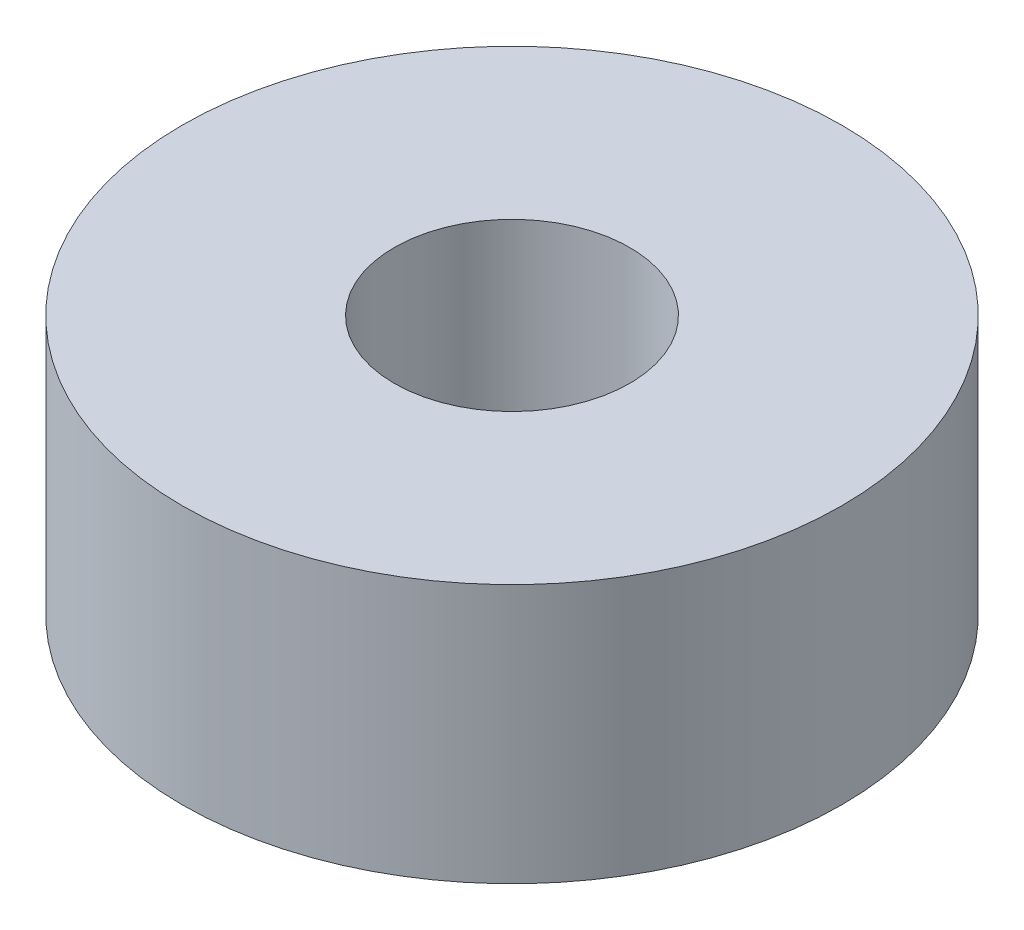
ISO-10303-21;
HEADER;
FILE_DESCRIPTION(('STEP AP214'),'2;1');
FILE_NAME('part.step','',(''),(''),'','','');
FILE_SCHEMA(('AUTOMOTIVE_DESIGN { 1 0 10303 214 1 1 1 1 }'));
ENDSEC;
DATA;
#1=APPLICATION_CONTEXT('core data for automotive mechanical design processes');
#2=APPLICATION_PROTOCOL_DEFINITION('international standard','automotive_design',2000,#1);
#3=PRODUCT_CONTEXT('',#1,'mechanical');
#4=PRODUCT('Part','Part','',(#3));
#5=PRODUCT_RELATED_PRODUCT_CATEGORY('part','',(#4));
#6=PRODUCT_DEFINITION_FORMATION('','',#4);
#7=PRODUCT_DEFINITION_CONTEXT('part definition',#1,'design');
#8=PRODUCT_DEFINITION('design','',#6,#7);
#9=PRODUCT_DEFINITION_SHAPE('','',#8);
#10=(LENGTH_UNIT() NAMED_UNIT(*) SI_UNIT(.MILLI.,.METRE.));
#11=(NAMED_UNIT(*) PLANE_ANGLE_UNIT() SI_UNIT($,.RADIAN.));
#12=(NAMED_UNIT(*) SI_UNIT($,.STERADIAN.) SOLID_ANGLE_UNIT());
#13=UNCERTAINTY_MEASURE_WITH_UNIT(LENGTH_MEASURE(1.E-05),#10,'distance_accuracy_value','');
#14=(GEOMETRIC_REPRESENTATION_CONTEXT(3) GLOBAL_UNCERTAINTY_ASSIGNED_CONTEXT((#13)) GLOBAL_UNIT_ASSIGNED_CONTEXT((#10,
#11,#12)) REPRESENTATION_CONTEXT('',''));
#15=CARTESIAN_POINT('',(0.,0.,0.));
#16=DIRECTION('',(0.,0.,1.));
#17=DIRECTION('',(1.,0.,0.));
#18=AXIS2_PLACEMENT_3D('',#15,#16,#17);
#19=CARTESIAN_POINT('',(0.,8.73125,0.));
#20=DIRECTION('',(0.,1.,0.));
#21=DIRECTION('',(0.,0.,1.));
#22=AXIS2_PLACEMENT_3D('',#19,#20,#21);
#23=PLANE('',#22);
#24=CARTESIAN_POINT('',(0.,8.73125,0.));
#25=DIRECTION('',(0.,1.,0.));
#26=DIRECTION('',(0.,0.,1.));
#27=AXIS2_PLACEMENT_3D('',#24,#25,#26);
#28=CIRCLE('',#27,11.1125);
#29=CARTESIAN_POINT('',(0.,8.73125,11.1125));
#30=VERTEX_POINT('',#29);
#31=EDGE_CURVE('E10',#30,#30,#28,.T.);
#32=ORIENTED_EDGE('',*,*,#31,.T.);
#33=EDGE_LOOP('',(#32));
#34=FACE_BOUND('',#33,.T.);
#35=CARTESIAN_POINT('',(0.,8.73125,0.));
#36=DIRECTION('',(0.,1.,0.));
#37=DIRECTION('',(0.,0.,1.));
#38=AXIS2_PLACEMENT_3D('',#35,#36,#37);
#39=CIRCLE('',#38,3.96875);
#40=CARTESIAN_POINT('',(0.,8.73125,3.96875));
#41=VERTEX_POINT('',#40);
#42=EDGE_CURVE('E50',#41,#41,#39,.T.);
#43=ORIENTED_EDGE('',*,*,#42,.F.);
#44=EDGE_LOOP('',(#43));
#45=FACE_BOUND('',#44,.T.);
#46=ADVANCED_FACE('F37',(#34,#45),#23,.T.);
#47=CARTESIAN_POINT('',(0.,0.,0.));
#48=DIRECTION('',(0.,1.,0.));
#49=DIRECTION('',(0.,0.,1.));
#50=AXIS2_PLACEMENT_3D('',#47,#48,#49);
#51=PLANE('',#50);
#52=CARTESIAN_POINT('',(0.,0.,0.));
#53=DIRECTION('',(0.,1.,0.));
#54=DIRECTION('',(0.,0.,1.));
#55=AXIS2_PLACEMENT_3D('',#52,#53,#54);
#56=CIRCLE('',#55,11.1125);
#57=CARTESIAN_POINT('',(0.,0.,11.1125));
#58=VERTEX_POINT('',#57);
#59=EDGE_CURVE('E41',#58,#58,#56,.T.);
#60=ORIENTED_EDGE('',*,*,#59,.F.);
#61=EDGE_LOOP('',(#60));
#62=FACE_BOUND('',#61,.T.);
#63=CARTESIAN_POINT('',(0.,0.,0.));
#64=DIRECTION('',(0.,1.,0.));
#65=DIRECTION('',(0.,0.,1.));
#66=AXIS2_PLACEMENT_3D('',#63,#64,#65);
#67=CIRCLE('',#66,3.96875);
#68=CARTESIAN_POINT('',(0.,0.,3.96875));
#69=VERTEX_POINT('',#68);
#70=EDGE_CURVE('E52',#69,#69,#67,.T.);
#71=ORIENTED_EDGE('',*,*,#70,.T.);
#72=EDGE_LOOP('',(#71));
#73=FACE_BOUND('',#72,.T.);
#74=ADVANCED_FACE('F64',(#62,#73),#51,.F.);
#75=CARTESIAN_POINT('',(0.,8.73125,0.));
#76=DIRECTION('',(0.,-1.,0.));
#77=DIRECTION('',(0.,0.,-1.));
#78=AXIS2_PLACEMENT_3D('',#75,#76,#77);
#79=CYLINDRICAL_SURFACE('',#78,11.1125);
#80=ORIENTED_EDGE('',*,*,#31,.F.);
#81=EDGE_LOOP('',(#80));
#82=FACE_BOUND('',#81,.T.);
#83=ORIENTED_EDGE('',*,*,#59,.T.);
#84=EDGE_LOOP('',(#83));
#85=FACE_BOUND('',#84,.T.);
#86=ADVANCED_FACE('F39',(#82,#85),#79,.T.);
#87=CARTESIAN_POINT('',(0.,8.73125,0.));
#88=DIRECTION('',(0.,-1.,0.));
#89=DIRECTION('',(0.,0.,-1.));
#90=AXIS2_PLACEMENT_3D('',#87,#88,#89);
#91=CYLINDRICAL_SURFACE('',#90,3.96875);
#92=ORIENTED_EDGE('',*,*,#42,.T.);
#93=EDGE_LOOP('',(#92));
#94=FACE_BOUND('',#93,.T.);
#95=ORIENTED_EDGE('',*,*,#70,.F.);
#96=EDGE_LOOP('',(#95));
#97=FACE_BOUND('',#96,.T.);
#98=ADVANCED_FACE('F60',(#94,#97),#91,.F.);
#99=CLOSED_SHELL('',(#46,#74,#86,#98));
#100=MANIFOLD_SOLID_BREP('B2',#99);
#101=ADVANCED_BREP_SHAPE_REPRESENTATION('',(#18,#100),#14);
#102=SHAPE_DEFINITION_REPRESENTATION(#9,#101);
ENDSEC;
END-ISO-10303-21;
